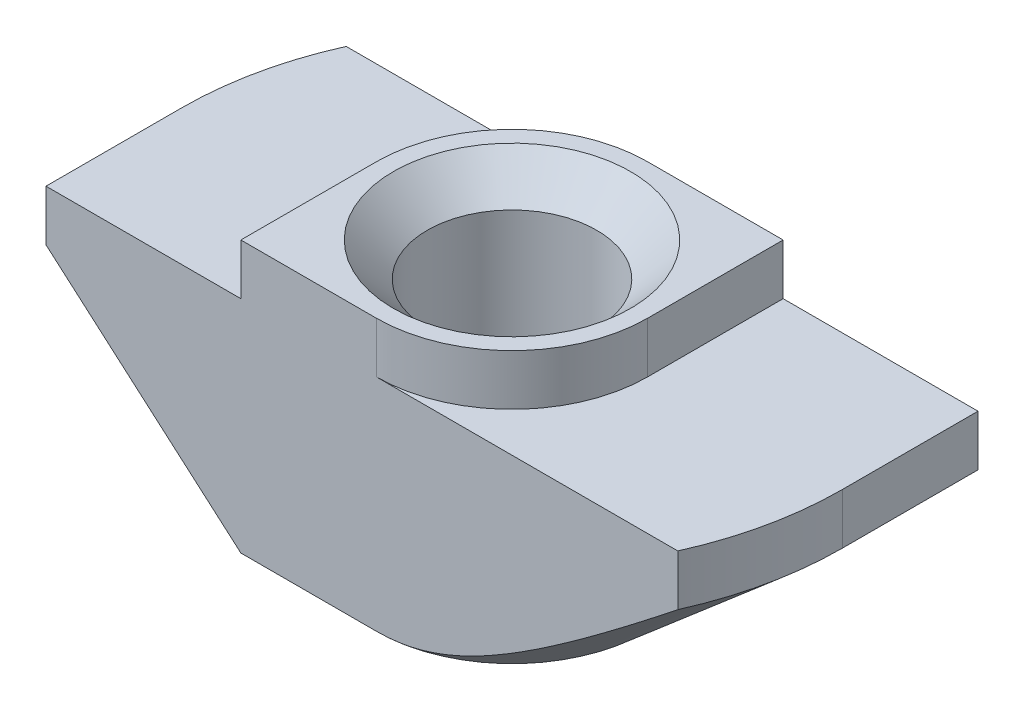
ISO-10303-21;
HEADER;
FILE_DESCRIPTION(('STEP AP214'),'2;1');
FILE_NAME('part.step','',(''),(''),'','','');
FILE_SCHEMA(('AUTOMOTIVE_DESIGN { 1 0 10303 214 1 1 1 1 }'));
ENDSEC;
DATA;
#1=APPLICATION_CONTEXT('core data for automotive mechanical design processes');
#2=APPLICATION_PROTOCOL_DEFINITION('international standard','automotive_design',2000,#1);
#3=PRODUCT_CONTEXT('',#1,'mechanical');
#4=PRODUCT('Part','Part','',(#3));
#5=PRODUCT_RELATED_PRODUCT_CATEGORY('part','',(#4));
#6=PRODUCT_DEFINITION_FORMATION('','',#4);
#7=PRODUCT_DEFINITION_CONTEXT('part definition',#1,'design');
#8=PRODUCT_DEFINITION('design','',#6,#7);
#9=PRODUCT_DEFINITION_SHAPE('','',#8);
#10=(LENGTH_UNIT() NAMED_UNIT(*) SI_UNIT(.MILLI.,.METRE.));
#11=(NAMED_UNIT(*) PLANE_ANGLE_UNIT() SI_UNIT($,.RADIAN.));
#12=(NAMED_UNIT(*) SI_UNIT($,.STERADIAN.) SOLID_ANGLE_UNIT());
#13=UNCERTAINTY_MEASURE_WITH_UNIT(LENGTH_MEASURE(1.E-05),#10,'distance_accuracy_value','');
#14=(GEOMETRIC_REPRESENTATION_CONTEXT(3) GLOBAL_UNCERTAINTY_ASSIGNED_CONTEXT((#13)) GLOBAL_UNIT_ASSIGNED_CONTEXT((#10,
#11,#12)) REPRESENTATION_CONTEXT('',''));
#15=CARTESIAN_POINT('',(0.,0.,0.));
#16=DIRECTION('',(0.,0.,1.));
#17=DIRECTION('',(1.,0.,0.));
#18=AXIS2_PLACEMENT_3D('',#15,#16,#17);
#19=CARTESIAN_POINT('',(-9.75,-1.5,4.));
#20=DIRECTION('',(1.,0.,0.));
#21=DIRECTION('',(0.,0.,-1.));
#22=AXIS2_PLACEMENT_3D('',#19,#20,#21);
#23=PLANE('',#22);
#24=DIRECTION('',(0.,0.,-1.));
#25=VECTOR('',#24,1.);
#26=CARTESIAN_POINT('',(-9.75,-3.,4.));
#27=LINE('',#26,#25);
#28=CARTESIAN_POINT('',(-9.75,-3.,4.));
#29=VERTEX_POINT('',#28);
#30=CARTESIAN_POINT('',(-9.75,-3.,0.));
#31=VERTEX_POINT('',#30);
#32=EDGE_CURVE('E317',#29,#31,#27,.T.);
#33=ORIENTED_EDGE('',*,*,#32,.F.);
#34=DIRECTION('',(0.,-1.,0.));
#35=VECTOR('',#34,1.);
#36=CARTESIAN_POINT('',(-9.75,-1.5,4.));
#37=LINE('',#36,#35);
#38=CARTESIAN_POINT('',(-9.75,-1.5,4.));
#39=VERTEX_POINT('',#38);
#40=EDGE_CURVE('E163',#39,#29,#37,.T.);
#41=ORIENTED_EDGE('',*,*,#40,.F.);
#42=DIRECTION('',(0.,0.,-1.));
#43=VECTOR('',#42,1.);
#44=CARTESIAN_POINT('',(-9.75,-1.5,4.));
#45=LINE('',#44,#43);
#46=CARTESIAN_POINT('',(-9.75,-1.5,0.));
#47=VERTEX_POINT('',#46);
#48=EDGE_CURVE('E45',#39,#47,#45,.T.);
#49=ORIENTED_EDGE('',*,*,#48,.T.);
#50=DIRECTION('',(0.,1.,0.));
#51=VECTOR('',#50,1.);
#52=CARTESIAN_POINT('',(-9.75,-8.,0.));
#53=LINE('',#52,#51);
#54=EDGE_CURVE('E209',#31,#47,#53,.T.);
#55=ORIENTED_EDGE('',*,*,#54,.F.);
#56=EDGE_LOOP('',(#33,#41,#49,#55));
#57=FACE_BOUND('',#56,.T.);
#58=ADVANCED_FACE('F37',(#57),#23,.F.);
#59=CARTESIAN_POINT('',(-9.75,-8.,4.));
#60=DIRECTION('',(0.,1.,0.));
#61=DIRECTION('',(0.,0.,1.));
#62=AXIS2_PLACEMENT_3D('',#59,#60,#61);
#63=PLANE('',#62);
#64=CARTESIAN_POINT('',(0.,-8.,0.));
#65=DIRECTION('',(0.,1.,0.));
#66=DIRECTION('',(0.,0.,1.));
#67=AXIS2_PLACEMENT_3D('',#64,#65,#66);
#68=CIRCLE('',#67,3.5);
#69=CARTESIAN_POINT('',(0.,-8.,3.5));
#70=VERTEX_POINT('',#69);
#71=EDGE_CURVE('E258',#70,#70,#68,.T.);
#72=ORIENTED_EDGE('',*,*,#71,.T.);
#73=EDGE_LOOP('',(#72));
#74=FACE_BOUND('',#73,.T.);
#75=DIRECTION('',(1.,0.,0.));
#76=VECTOR('',#75,1.);
#77=CARTESIAN_POINT('',(-9.75,-8.,4.));
#78=LINE('',#77,#76);
#79=CARTESIAN_POINT('',(-4.,-8.,4.));
#80=VERTEX_POINT('',#79);
#81=CARTESIAN_POINT('',(0.,-8.,4.));
#82=VERTEX_POINT('',#81);
#83=EDGE_CURVE('E161',#80,#82,#78,.T.);
#84=ORIENTED_EDGE('',*,*,#83,.F.);
#85=DIRECTION('',(0.,0.,-1.));
#86=VECTOR('',#85,1.);
#87=CARTESIAN_POINT('',(-4.,-8.,4.));
#88=LINE('',#87,#86);
#89=CARTESIAN_POINT('',(-4.,-8.,0.));
#90=VERTEX_POINT('',#89);
#91=EDGE_CURVE('E146',#80,#90,#88,.T.);
#92=ORIENTED_EDGE('',*,*,#91,.T.);
#93=CARTESIAN_POINT('',(0.,-8.,0.));
#94=DIRECTION('',(0.,-1.,0.));
#95=DIRECTION('',(-1.,0.,0.));
#96=AXIS2_PLACEMENT_3D('',#93,#94,#95);
#97=CIRCLE('',#96,4.);
#98=CARTESIAN_POINT('',(0.,-8.,-4.));
#99=VERTEX_POINT('',#98);
#100=EDGE_CURVE('E318',#90,#99,#97,.T.);
#101=ORIENTED_EDGE('',*,*,#100,.T.);
#102=DIRECTION('',(1.,0.,0.));
#103=VECTOR('',#102,1.);
#104=CARTESIAN_POINT('',(-9.75,-8.,-4.));
#105=LINE('',#104,#103);
#106=CARTESIAN_POINT('',(4.,-8.,-4.));
#107=VERTEX_POINT('',#106);
#108=EDGE_CURVE('E181',#99,#107,#105,.T.);
#109=ORIENTED_EDGE('',*,*,#108,.T.);
#110=DIRECTION('',(0.,0.,1.));
#111=VECTOR('',#110,1.);
#112=CARTESIAN_POINT('',(4.,-8.,-9.75));
#113=LINE('',#112,#111);
#114=CARTESIAN_POINT('',(4.,-8.,0.));
#115=VERTEX_POINT('',#114);
#116=EDGE_CURVE('E52',#107,#115,#113,.T.);
#117=ORIENTED_EDGE('',*,*,#116,.T.);
#118=CARTESIAN_POINT('',(0.,-8.,0.));
#119=DIRECTION('',(0.,-1.,0.));
#120=DIRECTION('',(1.,0.,0.));
#121=AXIS2_PLACEMENT_3D('',#118,#119,#120);
#122=CIRCLE('',#121,4.);
#123=EDGE_CURVE('E167',#115,#82,#122,.T.);
#124=ORIENTED_EDGE('',*,*,#123,.T.);
#125=EDGE_LOOP('',(#84,#92,#101,#109,#117,#124));
#126=FACE_BOUND('',#125,.T.);
#127=ADVANCED_FACE('F166',(#74,#126),#63,.F.);
#128=CARTESIAN_POINT('',(9.75,-1.5,4.));
#129=DIRECTION('',(-1.,0.,0.));
#130=DIRECTION('',(0.,0.,1.));
#131=AXIS2_PLACEMENT_3D('',#128,#129,#130);
#132=PLANE('',#131);
#133=DIRECTION('',(0.,0.,1.));
#134=VECTOR('',#133,1.);
#135=CARTESIAN_POINT('',(9.75,-3.,-9.75));
#136=LINE('',#135,#134);
#137=CARTESIAN_POINT('',(9.75,-3.,-4.));
#138=VERTEX_POINT('',#137);
#139=CARTESIAN_POINT('',(9.75,-3.,0.));
#140=VERTEX_POINT('',#139);
#141=EDGE_CURVE('E305',#138,#140,#136,.T.);
#142=ORIENTED_EDGE('',*,*,#141,.F.);
#143=DIRECTION('',(0.,1.,0.));
#144=VECTOR('',#143,1.);
#145=CARTESIAN_POINT('',(9.75,-1.5,-4.));
#146=LINE('',#145,#144);
#147=CARTESIAN_POINT('',(9.75,-1.5,-4.));
#148=VERTEX_POINT('',#147);
#149=EDGE_CURVE('E185',#138,#148,#146,.T.);
#150=ORIENTED_EDGE('',*,*,#149,.T.);
#151=DIRECTION('',(0.,0.,-1.));
#152=VECTOR('',#151,1.);
#153=CARTESIAN_POINT('',(9.75,-1.5,4.));
#154=LINE('',#153,#152);
#155=CARTESIAN_POINT('',(9.75,-1.5,0.));
#156=VERTEX_POINT('',#155);
#157=EDGE_CURVE('E203',#156,#148,#154,.T.);
#158=ORIENTED_EDGE('',*,*,#157,.F.);
#159=DIRECTION('',(0.,1.,0.));
#160=VECTOR('',#159,1.);
#161=CARTESIAN_POINT('',(9.75,-8.,0.));
#162=LINE('',#161,#160);
#163=EDGE_CURVE('E220',#140,#156,#162,.T.);
#164=ORIENTED_EDGE('',*,*,#163,.F.);
#165=EDGE_LOOP('',(#142,#150,#158,#164));
#166=FACE_BOUND('',#165,.T.);
#167=ADVANCED_FACE('F304',(#166),#132,.F.);
#168=CARTESIAN_POINT('',(0.,0.,4.));
#169=DIRECTION('',(0.,0.,-1.));
#170=DIRECTION('',(-1.,0.,0.));
#171=AXIS2_PLACEMENT_3D('',#168,#169,#170);
#172=PLANE('',#171);
#173=DIRECTION('',(-0.754605522163505,0.656178714924787,0.));
#174=VECTOR('',#173,1.);
#175=CARTESIAN_POINT('',(-4.,-8.,4.));
#176=LINE('',#175,#174);
#177=EDGE_CURVE('E149',#80,#29,#176,.T.);
#178=ORIENTED_EDGE('',*,*,#177,.F.);
#179=ORIENTED_EDGE('',*,*,#83,.T.);
#180=CARTESIAN_POINT('',(19.0930125034409,5.48479531743841,4.));
#181=CARTESIAN_POINT('',(18.5778133169644,5.04634478096504,4.));
#182=CARTESIAN_POINT('',(18.0622729802475,4.60829381291386,4.));
#183=CARTESIAN_POINT('',(17.0302280235104,3.73329525980051,4.));
#184=CARTESIAN_POINT('',(16.5137233725138,3.29634771128181,4.));
#185=CARTESIAN_POINT('',(15.47863444366,2.42315755061796,4.));
#186=CARTESIAN_POINT('',(14.9600481309705,1.98691734873569,4.));
#187=CARTESIAN_POINT('',(13.9212553406501,1.11639739796508,4.));
#188=CARTESIAN_POINT('',(13.401048906075,0.682117597716457,4.));
#189=CARTESIAN_POINT('',(12.3246773818503,-0.21175731208505,4.));
#190=CARTESIAN_POINT('',(11.7683628761931,-0.671172901903966,4.));
#191=CARTESIAN_POINT('',(10.9310662928984,-1.35689819172363,4.));
#192=CARTESIAN_POINT('',(10.6514842055428,-1.58491694423187,4.));
#193=CARTESIAN_POINT('',(10.0911578682021,-2.03952130793857,4.));
#194=CARTESIAN_POINT('',(9.81041362223716,-2.26610692408762,4.));
#195=CARTESIAN_POINT('',(9.24775627916612,-2.71723925573111,4.));
#196=CARTESIAN_POINT('',(8.96584464993702,-2.94178780024051,4.));
#197=CARTESIAN_POINT('',(8.40017784545761,-3.38854835363034,4.));
#198=CARTESIAN_POINT('',(8.11642269007676,-3.61076038762625,4.));
#199=CARTESIAN_POINT('',(7.54655666760194,-4.05206638411712,4.));
#200=CARTESIAN_POINT('',(7.26044612879617,-4.27116076990599,4.));
#201=CARTESIAN_POINT('',(6.68506947716327,-4.70515877749395,4.));
#202=CARTESIAN_POINT('',(6.39580350808307,-4.92006258896335,4.));
#203=CARTESIAN_POINT('',(5.94380391200236,-5.24880354329621,4.));
#204=CARTESIAN_POINT('',(5.7825678290859,-5.3646987592163,4.));
#205=CARTESIAN_POINT('',(5.45852078349081,-5.59427839205067,4.));
#206=CARTESIAN_POINT('',(5.29570978752578,-5.70796276208432,4.));
#207=CARTESIAN_POINT('',(4.96801437116113,-5.93271086070198,4.));
#208=CARTESIAN_POINT('',(4.80312782045187,-6.04377149083704,4.));
#209=CARTESIAN_POINT('',(4.47106545917387,-6.26241638816355,4.));
#210=CARTESIAN_POINT('',(4.3038897228336,-6.37000076769662,4.));
#211=CARTESIAN_POINT('',(3.96779734207744,-6.58006534355457,4.));
#212=CARTESIAN_POINT('',(3.79889805399672,-6.68257318482784,4.));
#213=CARTESIAN_POINT('',(3.45771491043147,-6.88190221849361,4.));
#214=CARTESIAN_POINT('',(3.28543046434657,-6.97872240660534,4.));
#215=CARTESIAN_POINT('',(2.93709738155444,-7.1646860244681,4.));
#216=CARTESIAN_POINT('',(2.76105538763457,-7.25384179412908,4.));
#217=CARTESIAN_POINT('',(2.40427915744407,-7.42212304050504,4.));
#218=CARTESIAN_POINT('',(2.22354728037757,-7.50125344690475,4.));
#219=CARTESIAN_POINT('',(1.87877415331493,-7.6374635749479,4.));
#220=CARTESIAN_POINT('',(1.71533550918919,-7.69605023700292,4.));
#221=CARTESIAN_POINT('',(1.3842626600524,-7.80005250313673,4.));
#222=CARTESIAN_POINT('',(1.21662899480356,-7.84546979231455,4.));
#223=CARTESIAN_POINT('',(0.879640019068342,-7.9196719407948,4.));
#224=CARTESIAN_POINT('',(0.710326071439545,-7.94864036786479,4.));
#225=CARTESIAN_POINT('',(0.369553218503112,-7.9882685957749,4.));
#226=CARTESIAN_POINT('',(0.198094873403108,-7.99893308174377,4.));
#227=CARTESIAN_POINT('',(-0.14622215115853,-8.00092076503876,4.));
#228=CARTESIAN_POINT('',(-0.319081718741123,-7.9920988065105,4.));
#229=CARTESIAN_POINT('',(-0.66279617162969,-7.95570116318786,4.));
#230=CARTESIAN_POINT('',(-0.833650530135947,-7.92812065766392,4.));
#231=CARTESIAN_POINT('',(-1.17380899940443,-7.85620687940474,4.));
#232=CARTESIAN_POINT('',(-1.34307188352269,-7.811682245836,4.));
#233=CARTESIAN_POINT('',(-1.59373756175264,-7.73469658263694,4.));
#234=CARTESIAN_POINT('',(-1.67676247755531,-7.70733179971942,4.));
#235=CARTESIAN_POINT('',(-1.8417517988474,-7.6495708706268,4.));
#236=CARTESIAN_POINT('',(-1.92371622948916,-7.6191747964966,4.));
#237=CARTESIAN_POINT('',(-2.13504326669252,-7.53682619979317,4.));
#238=CARTESIAN_POINT('',(-2.26359986699921,-7.48280578099689,4.));
#239=CARTESIAN_POINT('',(-2.51824420204764,-7.36919866655113,4.));
#240=CARTESIAN_POINT('',(-2.64433129566204,-7.3096105480052,4.));
#241=CARTESIAN_POINT('',(-2.89436868902728,-7.18584959519642,4.));
#242=CARTESIAN_POINT('',(-3.01831691948272,-7.12167259961822,4.));
#243=CARTESIAN_POINT('',(-3.26422266973225,-6.98960098632555,4.));
#244=CARTESIAN_POINT('',(-3.38617997843972,-6.92170597769097,4.));
#245=CARTESIAN_POINT('',(-3.75029646649663,-6.71298185031499,4.));
#246=CARTESIAN_POINT('',(-3.98982159172294,-6.56756033192358,4.));
#247=CARTESIAN_POINT('',(-4.46340938681992,-6.26843578703017,4.));
#248=CARTESIAN_POINT('',(-4.69747464234275,-6.11473679951732,4.));
#249=CARTESIAN_POINT('',(-5.16321438853325,-5.80025182347771,4.));
#250=CARTESIAN_POINT('',(-5.39485991399544,-5.63942310121265,4.));
#251=CARTESIAN_POINT('',(-5.85502306619878,-5.31332270165477,4.));
#252=CARTESIAN_POINT('',(-6.08354037524194,-5.14805057807379,4.));
#253=CARTESIAN_POINT('',(-6.53765735729361,-4.81451787561935,4.));
#254=CARTESIAN_POINT('',(-6.76326204804518,-4.64626411196043,4.));
#255=CARTESIAN_POINT('',(-7.21253368666862,-4.3072099865075,4.));
#256=CARTESIAN_POINT('',(-7.43620070078051,-4.13640971231412,4.));
#257=CARTESIAN_POINT('',(-7.87440605894757,-3.79864870939196,4.));
#258=CARTESIAN_POINT('',(-8.08899613000098,-3.6317549946429,4.));
#259=CARTESIAN_POINT('',(-8.51708866686722,-3.29638802975018,4.));
#260=CARTESIAN_POINT('',(-8.73059061658266,-3.12791412140789,4.));
#261=CARTESIAN_POINT('',(-9.15412189702873,-2.79172022690956,4.));
#262=CARTESIAN_POINT('',(-9.36416259813433,-2.62401455116661,4.));
#263=CARTESIAN_POINT('',(-9.78334542346964,-2.28767615731866,4.));
#264=CARTESIAN_POINT('',(-9.99248790937981,-2.11904389012149,4.));
#265=CARTESIAN_POINT('',(-10.2013028815516,-1.95000895828563,4.));
#266=B_SPLINE_CURVE_WITH_KNOTS('',3,(#180,#181,#182,#183,#184,#185,#186,#187,#188,#189,#190,
#191,#192,#193,#194,#195,#196,#197,#198,#199,#200,#201,#202,#203,#204,#205,#206,#207,#208,#209,
#210,#211,#212,#213,#214,#215,#216,#217,#218,#219,#220,#221,#222,#223,#224,#225,#226,#227,#228,
#229,#230,#231,#232,#233,#234,#235,#236,#237,#238,#239,#240,#241,#242,#243,#244,#245,#246,#247,
#248,#249,#250,#251,#252,#253,#254,#255,#256,#257,#258,#259,#260,#261,#262,#263,#264,#265),
.UNSPECIFIED.,.F.,.F.,(4,2,2,2,2,2,2,2,2,2,2,2,2,2,2,2,2,2,2,2,2,2,2,2,2,2,2,2,2,2,2,2,2,2,2,2,
2,2,2,2,2,2,4),(0.,2.02953833455181,4.05914302502208,6.09215065585671,8.12510471143518,
10.2895570428798,11.371878906685,12.4541970297015,13.535421419087,14.6166341743324,
15.6976987012863,16.7787141838814,17.3744003174641,17.9700990687338,18.5664692951226,
19.1628202293636,19.7554524823498,20.3481890650503,20.9399527193616,21.5314242521027,
22.0518540383534,22.572217203124,23.086652881933,23.6009568646764,24.1191048434135,
24.637386030525,25.1617030827551,25.4239118441335,25.6861143750633,26.1042775249438,
26.5225478355647,26.9412023765355,27.3599010206039,28.2002514013315,29.0401953843998,
29.8861310854953,30.7321520707985,31.576440022776,32.4206989977375,33.236240856672,
34.052139001134,34.8584735236023,35.6644453613211),.UNSPECIFIED.);
#267=CARTESIAN_POINT('',(8.89170962188937,-3.,4.));
#268=VERTEX_POINT('',#267);
#269=EDGE_CURVE('E322',#268,#82,#266,.T.);
#270=ORIENTED_EDGE('',*,*,#269,.F.);
#271=DIRECTION('',(0.,1.,0.));
#272=VECTOR('',#271,1.);
#273=CARTESIAN_POINT('',(8.89170962188937,-8.,4.));
#274=LINE('',#273,#272);
#275=CARTESIAN_POINT('',(8.89170962188937,-1.5,4.));
#276=VERTEX_POINT('',#275);
#277=EDGE_CURVE('E223',#268,#276,#274,.T.);
#278=ORIENTED_EDGE('',*,*,#277,.T.);
#279=DIRECTION('',(-1.,0.,0.));
#280=VECTOR('',#279,1.);
#281=CARTESIAN_POINT('',(4.,-1.5,4.));
#282=LINE('',#281,#280);
#283=CARTESIAN_POINT('',(0.,-1.5,4.));
#284=VERTEX_POINT('',#283);
#285=EDGE_CURVE('E168',#276,#284,#282,.T.);
#286=ORIENTED_EDGE('',*,*,#285,.T.);
#287=DIRECTION('',(0.,1.,0.));
#288=VECTOR('',#287,1.);
#289=CARTESIAN_POINT('',(0.,-7.15685424949238,4.));
#290=LINE('',#289,#288);
#291=CARTESIAN_POINT('',(0.,0.,4.));
#292=VERTEX_POINT('',#291);
#293=EDGE_CURVE('E246',#284,#292,#290,.T.);
#294=ORIENTED_EDGE('',*,*,#293,.T.);
#295=DIRECTION('',(-1.,0.,0.));
#296=VECTOR('',#295,1.);
#297=CARTESIAN_POINT('',(4.,0.,4.));
#298=LINE('',#297,#296);
#299=CARTESIAN_POINT('',(-4.,0.,4.));
#300=VERTEX_POINT('',#299);
#301=EDGE_CURVE('E170',#292,#300,#298,.T.);
#302=ORIENTED_EDGE('',*,*,#301,.T.);
#303=DIRECTION('',(0.,-1.,0.));
#304=VECTOR('',#303,1.);
#305=CARTESIAN_POINT('',(-4.,0.,4.));
#306=LINE('',#305,#304);
#307=CARTESIAN_POINT('',(-4.,-1.5,4.));
#308=VERTEX_POINT('',#307);
#309=EDGE_CURVE('E196',#300,#308,#306,.T.);
#310=ORIENTED_EDGE('',*,*,#309,.T.);
#311=DIRECTION('',(-1.,0.,0.));
#312=VECTOR('',#311,1.);
#313=CARTESIAN_POINT('',(-4.,-1.5,4.));
#314=LINE('',#313,#312);
#315=EDGE_CURVE('E172',#308,#39,#314,.T.);
#316=ORIENTED_EDGE('',*,*,#315,.T.);
#317=ORIENTED_EDGE('',*,*,#40,.T.);
#318=EDGE_LOOP('',(#178,#179,#270,#278,#286,#294,#302,#310,#316,#317));
#319=FACE_BOUND('',#318,.T.);
#320=ADVANCED_FACE('F159',(#319),#172,.F.);
#321=CARTESIAN_POINT('',(0.,0.,-4.));
#322=DIRECTION('',(0.,0.,-1.));
#323=DIRECTION('',(-1.,0.,0.));
#324=AXIS2_PLACEMENT_3D('',#321,#322,#323);
#325=PLANE('',#324);
#326=ORIENTED_EDGE('',*,*,#108,.F.);
#327=CARTESIAN_POINT('',(10.2013028815516,-1.95000895828561,-4.));
#328=CARTESIAN_POINT('',(10.0339198393362,-2.08551143614665,-4.));
#329=CARTESIAN_POINT('',(9.86632283217457,-2.2207499092589,-4.));
#330=CARTESIAN_POINT('',(9.5306291113076,-2.49060788617074,-4.));
#331=CARTESIAN_POINT('',(9.3625323935981,-2.6252273849884,-4.));
#332=CARTESIAN_POINT('',(8.85711014174881,-3.02824011005636,-4.));
#333=CARTESIAN_POINT('',(8.51892952893781,-3.29556281198958,-4.));
#334=CARTESIAN_POINT('',(7.82606328189803,-3.83681323070731,-4.));
#335=CARTESIAN_POINT('',(7.47125417808717,-4.11058357354471,-4.));
#336=CARTESIAN_POINT('',(6.93566544519761,-4.51652980873558,-4.));
#337=CARTESIAN_POINT('',(6.75663624561629,-4.65101435659177,-4.));
#338=CARTESIAN_POINT('',(6.39716787276301,-4.91808381202073,-4.));
#339=CARTESIAN_POINT('',(6.21672871850456,-5.05066874514209,-4.));
#340=CARTESIAN_POINT('',(5.85418369277563,-5.31345193555315,-4.));
#341=CARTESIAN_POINT('',(5.67207823226353,-5.44365075874076,-4.));
#342=CARTESIAN_POINT('',(5.30576731880303,-5.70107997472775,-4.));
#343=CARTESIAN_POINT('',(5.12156180206058,-5.82831027699185,-4.));
#344=CARTESIAN_POINT('',(4.75011127026993,-6.07925940964712,-4.));
#345=CARTESIAN_POINT('',(4.56285994512742,-6.20296893308306,-4.));
#346=CARTESIAN_POINT('',(4.18513224883839,-6.44535805808298,-4.));
#347=CARTESIAN_POINT('',(3.99465611805763,-6.56403803224218,-4.));
#348=CARTESIAN_POINT('',(3.61304128488062,-6.79266272765141,-4.));
#349=CARTESIAN_POINT('',(3.42197306424269,-6.90272431468641,-4.));
#350=CARTESIAN_POINT('',(3.03491286140894,-7.11411820657794,-4.));
#351=CARTESIAN_POINT('',(2.83891889996064,-7.21544692756372,-4.));
#352=CARTESIAN_POINT('',(2.44192184290774,-7.40560938726516,-4.));
#353=CARTESIAN_POINT('',(2.24094385599254,-7.49449488615489,-4.));
#354=CARTESIAN_POINT('',(1.8325063106098,-7.65562668554541,-4.));
#355=CARTESIAN_POINT('',(1.62505480048051,-7.72789278037345,-4.));
#356=CARTESIAN_POINT('',(1.27981814559727,-7.82796451166703,-4.));
#357=CARTESIAN_POINT('',(1.14396110792812,-7.86239848800736,-4.));
#358=CARTESIAN_POINT('',(0.869910445029896,-7.92056970940938,-4.));
#359=CARTESIAN_POINT('',(0.731716453760718,-7.94430526235705,-4.));
#360=CARTESIAN_POINT('',(0.454464556175093,-7.97964173047544,-4.));
#361=CARTESIAN_POINT('',(0.315414459383221,-7.99130291119976,-4.));
#362=CARTESIAN_POINT('',(0.0368276951767137,-8.0019571726022,-4.));
#363=CARTESIAN_POINT('',(-0.102708943731008,-8.00095098340584,-4.));
#364=CARTESIAN_POINT('',(-0.38098249054024,-7.9863455393582,-4.));
#365=CARTESIAN_POINT('',(-0.519720005408902,-7.97275762445244,-4.));
#366=CARTESIAN_POINT('',(-0.795526149407617,-7.93385441309408,-4.));
#367=CARTESIAN_POINT('',(-0.932594595612336,-7.90853784287634,-4.));
#368=CARTESIAN_POINT('',(-1.20518982051904,-7.84736843394937,-4.));
#369=CARTESIAN_POINT('',(-1.34070240327483,-7.81145325217638,-4.));
#370=CARTESIAN_POINT('',(-1.60900813965177,-7.73074156625156,-4.));
#371=CARTESIAN_POINT('',(-1.74180146424736,-7.68594562238459,-4.));
#372=CARTESIAN_POINT('',(-2.06774555470206,-7.56574973434711,-4.));
#373=CARTESIAN_POINT('',(-2.25927747683547,-7.48597990119863,-4.));
#374=CARTESIAN_POINT('',(-2.63698467897033,-7.31453077262157,-4.));
#375=CARTESIAN_POINT('',(-2.82315606434946,-7.22284307246944,-4.));
#376=CARTESIAN_POINT('',(-3.19133344589281,-7.0304609141347,-4.));
#377=CARTESIAN_POINT('',(-3.37332794720551,-6.92974465007832,-4.));
#378=CARTESIAN_POINT('',(-3.7334477915038,-6.72176852295224,-4.));
#379=CARTESIAN_POINT('',(-3.91157408445031,-6.6145102916867,-4.));
#380=CARTESIAN_POINT('',(-4.26690326443273,-6.39365749074014,-4.));
#381=CARTESIAN_POINT('',(-4.444067421961,-6.2800009179053,-4.));
#382=CARTESIAN_POINT('',(-4.79581550110569,-6.0487604594614,-4.));
#383=CARTESIAN_POINT('',(-4.97039930014717,-5.93117638814353,-4.));
#384=CARTESIAN_POINT('',(-5.31718243657692,-5.69312760113897,-4.));
#385=CARTESIAN_POINT('',(-5.48938509058574,-5.57266770382255,-4.));
#386=CARTESIAN_POINT('',(-5.832052772288,-5.32931648933681,-4.));
#387=CARTESIAN_POINT('',(-6.0025178459933,-5.20642523680557,-4.));
#388=CARTESIAN_POINT('',(-6.46417550999881,-4.86955059087449,-4.));
#389=CARTESIAN_POINT('',(-6.75397131864408,-4.6536542948738,-4.));
#390=CARTESIAN_POINT('',(-7.33046309681157,-4.217755036655,-4.));
#391=CARTESIAN_POINT('',(-7.61715893303351,-3.99775189894105,-4.));
#392=CARTESIAN_POINT('',(-8.18823393079153,-3.55468662675595,-4.));
#393=CARTESIAN_POINT('',(-8.47261278287653,-3.33162409401831,-4.));
#394=CARTESIAN_POINT('',(-9.03955595713135,-2.88320266419135,-4.));
#395=CARTESIAN_POINT('',(-9.32212026063873,-2.6578437435454,-4.));
#396=CARTESIAN_POINT('',(-9.886143453162,-2.20508818164028,-4.));
#397=CARTESIAN_POINT('',(-10.1676007023281,-1.97768949943048,-4.));
#398=CARTESIAN_POINT('',(-10.7293691975362,-1.52148028275231,-4.));
#399=CARTESIAN_POINT('',(-11.0096804397628,-1.29266974358973,-4.));
#400=CARTESIAN_POINT('',(-11.8491851542355,-0.604591320533747,-4.));
#401=CARTESIAN_POINT('',(-12.4069971523932,-0.143638301746192,-4.));
#402=CARTESIAN_POINT('',(-13.4777900145884,0.746108447391972,-4.));
#403=CARTESIAN_POINT('',(-13.9909542215763,1.17468201561434,-4.));
#404=CARTESIAN_POINT('',(-15.0157237514183,2.03371405569384,-4.));
#405=CARTESIAN_POINT('',(-15.5273290352433,2.46417257409544,-4.));
#406=CARTESIAN_POINT('',(-16.5484683455278,3.32572688529102,-4.));
#407=CARTESIAN_POINT('',(-17.0580044304759,3.7568202401299,-4.));
#408=CARTESIAN_POINT('',(-18.0761421237496,4.6200775417147,-4.));
#409=CARTESIAN_POINT('',(-18.5847437603499,5.05224145510645,-4.));
#410=CARTESIAN_POINT('',(-19.0930125034409,5.48479531743842,-4.));
#411=B_SPLINE_CURVE_WITH_KNOTS('',3,(#327,#328,#329,#330,#331,#332,#333,#334,#335,#336,#337,
#338,#339,#340,#341,#342,#343,#344,#345,#346,#347,#348,#349,#350,#351,#352,#353,#354,#355,#356,
#357,#358,#359,#360,#361,#362,#363,#364,#365,#366,#367,#368,#369,#370,#371,#372,#373,#374,#375,
#376,#377,#378,#379,#380,#381,#382,#383,#384,#385,#386,#387,#388,#389,#390,#391,#392,#393,#394,
#395,#396,#397,#398,#399,#400,#401,#402,#403,#404,#405,#406,#407,#408,#409,#410),.UNSPECIFIED.,
.F.,.F.,(4,2,2,2,2,2,2,2,2,2,2,2,2,2,2,2,2,2,2,2,2,2,2,2,2,2,2,2,2,2,2,2,2,2,2,2,2,2,2,2,2,4),
(0.,0.646066469562852,1.29213813004586,2.58535159892046,3.92975214476226,4.60148503690557,
5.27320888617807,5.94477130988362,6.6163541884943,7.28957271997509,7.96274129110434,
8.6240786797822,9.28568619424606,9.94445418525195,10.6024334479883,11.0225346289763,
11.442702231889,11.8607624364611,12.2787985448689,12.6964582424969,13.1141633097869,
13.5343761117408,13.9545624110161,14.576405787849,15.1986901050663,15.8225200909053,
16.4461951022656,17.0775908972504,17.709016589694,18.3394497925658,18.9698662577038,
20.0539373371927,21.1380548483351,22.2223148532865,23.3065859919301,24.3921009102971,
25.4776194397949,27.6484733081619,29.6542390606716,31.6600546233868,33.6623558511828,
35.6645954610344),.UNSPECIFIED.);
#412=CARTESIAN_POINT('',(-8.89170962188937,-3.,-4.));
#413=VERTEX_POINT('',#412);
#414=EDGE_CURVE('E227',#99,#413,#411,.T.);
#415=ORIENTED_EDGE('',*,*,#414,.T.);
#416=DIRECTION('',(0.,1.,0.));
#417=VECTOR('',#416,1.);
#418=CARTESIAN_POINT('',(-8.89170962188937,-8.,-4.));
#419=LINE('',#418,#417);
#420=CARTESIAN_POINT('',(-8.89170962188937,-1.5,-4.));
#421=VERTEX_POINT('',#420);
#422=EDGE_CURVE('E219',#413,#421,#419,.T.);
#423=ORIENTED_EDGE('',*,*,#422,.T.);
#424=DIRECTION('',(-1.,0.,0.));
#425=VECTOR('',#424,1.);
#426=CARTESIAN_POINT('',(-4.,-1.5,-4.));
#427=LINE('',#426,#425);
#428=CARTESIAN_POINT('',(0.,-1.5,-4.));
#429=VERTEX_POINT('',#428);
#430=EDGE_CURVE('E178',#429,#421,#427,.T.);
#431=ORIENTED_EDGE('',*,*,#430,.F.);
#432=DIRECTION('',(0.,1.,0.));
#433=VECTOR('',#432,1.);
#434=CARTESIAN_POINT('',(0.,-7.15685424949238,-4.));
#435=LINE('',#434,#433);
#436=CARTESIAN_POINT('',(0.,0.,-4.));
#437=VERTEX_POINT('',#436);
#438=EDGE_CURVE('E255',#429,#437,#435,.T.);
#439=ORIENTED_EDGE('',*,*,#438,.T.);
#440=DIRECTION('',(-1.,0.,0.));
#441=VECTOR('',#440,1.);
#442=CARTESIAN_POINT('',(4.,0.,-4.));
#443=LINE('',#442,#441);
#444=CARTESIAN_POINT('',(4.,0.,-4.));
#445=VERTEX_POINT('',#444);
#446=EDGE_CURVE('E193',#445,#437,#443,.T.);
#447=ORIENTED_EDGE('',*,*,#446,.F.);
#448=DIRECTION('',(0.,1.,0.));
#449=VECTOR('',#448,1.);
#450=CARTESIAN_POINT('',(4.,0.,-4.));
#451=LINE('',#450,#449);
#452=CARTESIAN_POINT('',(4.,-1.5,-4.));
#453=VERTEX_POINT('',#452);
#454=EDGE_CURVE('E190',#453,#445,#451,.T.);
#455=ORIENTED_EDGE('',*,*,#454,.F.);
#456=DIRECTION('',(-1.,0.,0.));
#457=VECTOR('',#456,1.);
#458=CARTESIAN_POINT('',(4.,-1.5,-4.));
#459=LINE('',#458,#457);
#460=EDGE_CURVE('E187',#148,#453,#459,.T.);
#461=ORIENTED_EDGE('',*,*,#460,.F.);
#462=ORIENTED_EDGE('',*,*,#149,.F.);
#463=DIRECTION('',(-0.754605522163505,-0.656178714924787,0.));
#464=VECTOR('',#463,1.);
#465=CARTESIAN_POINT('',(5.68353067814855,-6.53606027987083,-4.));
#466=LINE('',#465,#464);
#467=EDGE_CURVE('E314',#138,#107,#466,.T.);
#468=ORIENTED_EDGE('',*,*,#467,.T.);
#469=EDGE_LOOP('',(#326,#415,#423,#431,#439,#447,#455,#461,#462,#468));
#470=FACE_BOUND('',#469,.T.);
#471=ADVANCED_FACE('F283',(#470),#325,.T.);
#472=CARTESIAN_POINT('',(0.,-8.,0.));
#473=DIRECTION('',(0.,1.,0.));
#474=DIRECTION('',(-1.,0.,0.));
#475=AXIS2_PLACEMENT_3D('',#472,#473,#474);
#476=CYLINDRICAL_SURFACE('',#475,9.75);
#477=CARTESIAN_POINT('',(0.,-3.,0.));
#478=DIRECTION('',(0.,-1.,0.));
#479=DIRECTION('',(-1.,0.,0.));
#480=AXIS2_PLACEMENT_3D('',#477,#478,#479);
#481=CIRCLE('',#480,9.75);
#482=EDGE_CURVE('E60',#31,#413,#481,.T.);
#483=ORIENTED_EDGE('',*,*,#482,.F.);
#484=ORIENTED_EDGE('',*,*,#54,.T.);
#485=CARTESIAN_POINT('',(0.,-1.5,0.));
#486=DIRECTION('',(0.,-1.,0.));
#487=DIRECTION('',(-1.,0.,0.));
#488=AXIS2_PLACEMENT_3D('',#485,#486,#487);
#489=CIRCLE('',#488,9.75);
#490=EDGE_CURVE('E215',#47,#421,#489,.T.);
#491=ORIENTED_EDGE('',*,*,#490,.T.);
#492=ORIENTED_EDGE('',*,*,#422,.F.);
#493=EDGE_LOOP('',(#483,#484,#491,#492));
#494=FACE_BOUND('',#493,.T.);
#495=ADVANCED_FACE('F345',(#494),#476,.T.);
#496=CARTESIAN_POINT('',(0.,-8.,0.));
#497=DIRECTION('',(0.,1.,0.));
#498=DIRECTION('',(-1.,0.,0.));
#499=AXIS2_PLACEMENT_3D('',#496,#497,#498);
#500=CYLINDRICAL_SURFACE('',#499,9.75);
#501=CARTESIAN_POINT('',(0.,-3.,0.));
#502=DIRECTION('',(0.,-1.,0.));
#503=DIRECTION('',(1.,0.,0.));
#504=AXIS2_PLACEMENT_3D('',#501,#502,#503);
#505=CIRCLE('',#504,9.75);
#506=EDGE_CURVE('E310',#140,#268,#505,.T.);
#507=ORIENTED_EDGE('',*,*,#506,.F.);
#508=ORIENTED_EDGE('',*,*,#163,.T.);
#509=CARTESIAN_POINT('',(0.,-1.5,0.));
#510=DIRECTION('',(0.,-1.,0.));
#511=DIRECTION('',(1.,0.,0.));
#512=AXIS2_PLACEMENT_3D('',#509,#510,#511);
#513=CIRCLE('',#512,9.75);
#514=EDGE_CURVE('E237',#156,#276,#513,.T.);
#515=ORIENTED_EDGE('',*,*,#514,.T.);
#516=ORIENTED_EDGE('',*,*,#277,.F.);
#517=EDGE_LOOP('',(#507,#508,#515,#516));
#518=FACE_BOUND('',#517,.T.);
#519=ADVANCED_FACE('F348',(#518),#500,.T.);
#520=CARTESIAN_POINT('',(4.,0.,4.));
#521=DIRECTION('',(0.,-1.,0.));
#522=DIRECTION('',(0.,0.,-1.));
#523=AXIS2_PLACEMENT_3D('',#520,#521,#522);
#524=PLANE('',#523);
#525=ORIENTED_EDGE('',*,*,#301,.F.);
#526=CARTESIAN_POINT('',(0.,0.,0.));
#527=DIRECTION('',(0.,-1.,0.));
#528=DIRECTION('',(0.,0.,-1.));
#529=AXIS2_PLACEMENT_3D('',#526,#527,#528);
#530=CIRCLE('',#529,4.);
#531=CARTESIAN_POINT('',(4.,0.,0.));
#532=VERTEX_POINT('',#531);
#533=EDGE_CURVE('E235',#532,#292,#530,.T.);
#534=ORIENTED_EDGE('',*,*,#533,.F.);
#535=DIRECTION('',(0.,0.,-1.));
#536=VECTOR('',#535,1.);
#537=CARTESIAN_POINT('',(4.,0.,4.));
#538=LINE('',#537,#536);
#539=EDGE_CURVE('E199',#532,#445,#538,.T.);
#540=ORIENTED_EDGE('',*,*,#539,.T.);
#541=ORIENTED_EDGE('',*,*,#446,.T.);
#542=CARTESIAN_POINT('',(0.,0.,0.));
#543=DIRECTION('',(0.,-1.,0.));
#544=DIRECTION('',(0.,0.,-1.));
#545=AXIS2_PLACEMENT_3D('',#542,#543,#544);
#546=CIRCLE('',#545,4.);
#547=CARTESIAN_POINT('',(-4.,0.,0.));
#548=VERTEX_POINT('',#547);
#549=EDGE_CURVE('E250',#548,#437,#546,.T.);
#550=ORIENTED_EDGE('',*,*,#549,.F.);
#551=DIRECTION('',(0.,0.,-1.));
#552=VECTOR('',#551,1.);
#553=CARTESIAN_POINT('',(-4.,0.,4.));
#554=LINE('',#553,#552);
#555=EDGE_CURVE('E177',#300,#548,#554,.T.);
#556=ORIENTED_EDGE('',*,*,#555,.F.);
#557=EDGE_LOOP('',(#525,#534,#540,#541,#550,#556));
#558=FACE_BOUND('',#557,.T.);
#559=CARTESIAN_POINT('',(0.,0.,0.));
#560=DIRECTION('',(0.,1.,0.));
#561=DIRECTION('',(0.,0.,1.));
#562=AXIS2_PLACEMENT_3D('',#559,#560,#561);
#563=CIRCLE('',#562,3.5);
#564=CARTESIAN_POINT('',(0.,0.,3.5));
#565=VERTEX_POINT('',#564);
#566=EDGE_CURVE('E262',#565,#565,#563,.T.);
#567=ORIENTED_EDGE('',*,*,#566,.F.);
#568=EDGE_LOOP('',(#567));
#569=FACE_BOUND('',#568,.T.);
#570=ADVANCED_FACE('F286',(#558,#569),#524,.F.);
#571=CARTESIAN_POINT('',(-4.,0.,4.));
#572=DIRECTION('',(1.,0.,0.));
#573=DIRECTION('',(0.,0.,-1.));
#574=AXIS2_PLACEMENT_3D('',#571,#572,#573);
#575=PLANE('',#574);
#576=ORIENTED_EDGE('',*,*,#555,.T.);
#577=DIRECTION('',(0.,1.,0.));
#578=VECTOR('',#577,1.);
#579=CARTESIAN_POINT('',(-4.,-7.15685424949238,0.));
#580=LINE('',#579,#578);
#581=CARTESIAN_POINT('',(-4.,-1.5,0.));
#582=VERTEX_POINT('',#581);
#583=EDGE_CURVE('E252',#582,#548,#580,.T.);
#584=ORIENTED_EDGE('',*,*,#583,.F.);
#585=DIRECTION('',(0.,0.,-1.));
#586=VECTOR('',#585,1.);
#587=CARTESIAN_POINT('',(-4.,-1.5,4.));
#588=LINE('',#587,#586);
#589=EDGE_CURVE('E11',#308,#582,#588,.T.);
#590=ORIENTED_EDGE('',*,*,#589,.F.);
#591=ORIENTED_EDGE('',*,*,#309,.F.);
#592=EDGE_LOOP('',(#576,#584,#590,#591));
#593=FACE_BOUND('',#592,.T.);
#594=ADVANCED_FACE('F39',(#593),#575,.F.);
#595=CARTESIAN_POINT('',(-4.,-1.5,4.));
#596=DIRECTION('',(0.,-1.,0.));
#597=DIRECTION('',(1.,0.,0.));
#598=AXIS2_PLACEMENT_3D('',#595,#596,#597);
#599=PLANE('',#598);
#600=ORIENTED_EDGE('',*,*,#430,.T.);
#601=ORIENTED_EDGE('',*,*,#490,.F.);
#602=ORIENTED_EDGE('',*,*,#48,.F.);
#603=ORIENTED_EDGE('',*,*,#315,.F.);
#604=ORIENTED_EDGE('',*,*,#589,.T.);
#605=CARTESIAN_POINT('',(0.,-1.5,0.));
#606=DIRECTION('',(0.,-1.,0.));
#607=DIRECTION('',(1.,0.,0.));
#608=AXIS2_PLACEMENT_3D('',#605,#606,#607);
#609=CIRCLE('',#608,4.);
#610=EDGE_CURVE('E253',#582,#429,#609,.T.);
#611=ORIENTED_EDGE('',*,*,#610,.T.);
#612=EDGE_LOOP('',(#600,#601,#602,#603,#604,#611));
#613=FACE_BOUND('',#612,.T.);
#614=ADVANCED_FACE('F212',(#613),#599,.F.);
#615=CARTESIAN_POINT('',(4.,-1.5,4.));
#616=DIRECTION('',(0.,-1.,0.));
#617=DIRECTION('',(1.,0.,0.));
#618=AXIS2_PLACEMENT_3D('',#615,#616,#617);
#619=PLANE('',#618);
#620=ORIENTED_EDGE('',*,*,#285,.F.);
#621=ORIENTED_EDGE('',*,*,#514,.F.);
#622=ORIENTED_EDGE('',*,*,#157,.T.);
#623=ORIENTED_EDGE('',*,*,#460,.T.);
#624=DIRECTION('',(0.,0.,-1.));
#625=VECTOR('',#624,1.);
#626=CARTESIAN_POINT('',(4.,-1.5,4.));
#627=LINE('',#626,#625);
#628=CARTESIAN_POINT('',(4.,-1.5,0.));
#629=VERTEX_POINT('',#628);
#630=EDGE_CURVE('E201',#629,#453,#627,.T.);
#631=ORIENTED_EDGE('',*,*,#630,.F.);
#632=CARTESIAN_POINT('',(0.,-1.5,0.));
#633=DIRECTION('',(0.,-1.,0.));
#634=DIRECTION('',(1.,0.,0.));
#635=AXIS2_PLACEMENT_3D('',#632,#633,#634);
#636=CIRCLE('',#635,4.);
#637=EDGE_CURVE('E243',#629,#284,#636,.T.);
#638=ORIENTED_EDGE('',*,*,#637,.T.);
#639=EDGE_LOOP('',(#620,#621,#622,#623,#631,#638));
#640=FACE_BOUND('',#639,.T.);
#641=ADVANCED_FACE('F298',(#640),#619,.F.);
#642=CARTESIAN_POINT('',(4.,0.,4.));
#643=DIRECTION('',(-1.,0.,0.));
#644=DIRECTION('',(0.,0.,1.));
#645=AXIS2_PLACEMENT_3D('',#642,#643,#644);
#646=PLANE('',#645);
#647=ORIENTED_EDGE('',*,*,#539,.F.);
#648=DIRECTION('',(0.,1.,0.));
#649=VECTOR('',#648,1.);
#650=CARTESIAN_POINT('',(4.,-7.15685424949238,0.));
#651=LINE('',#650,#649);
#652=EDGE_CURVE('E242',#629,#532,#651,.T.);
#653=ORIENTED_EDGE('',*,*,#652,.F.);
#654=ORIENTED_EDGE('',*,*,#630,.T.);
#655=ORIENTED_EDGE('',*,*,#454,.T.);
#656=EDGE_LOOP('',(#647,#653,#654,#655));
#657=FACE_BOUND('',#656,.T.);
#658=ADVANCED_FACE('F292',(#657),#646,.F.);
#659=CARTESIAN_POINT('',(0.,-7.,0.));
#660=DIRECTION('',(0.,-1.,0.));
#661=DIRECTION('',(0.,0.,-1.));
#662=AXIS2_PLACEMENT_3D('',#659,#660,#661);
#663=CONICAL_SURFACE('',#662,2.5,0.785398163397448);
#664=ORIENTED_EDGE('',*,*,#71,.F.);
#665=EDGE_LOOP('',(#664));
#666=FACE_BOUND('',#665,.T.);
#667=CARTESIAN_POINT('',(0.,-7.,0.));
#668=DIRECTION('',(0.,1.,0.));
#669=DIRECTION('',(0.,0.,1.));
#670=AXIS2_PLACEMENT_3D('',#667,#668,#669);
#671=CIRCLE('',#670,2.5);
#672=CARTESIAN_POINT('',(0.,-7.,2.5));
#673=VERTEX_POINT('',#672);
#674=EDGE_CURVE('E182',#673,#673,#671,.T.);
#675=ORIENTED_EDGE('',*,*,#674,.T.);
#676=EDGE_LOOP('',(#675));
#677=FACE_BOUND('',#676,.T.);
#678=ADVANCED_FACE('F363',(#666,#677),#663,.F.);
#679=CARTESIAN_POINT('',(0.,0.,0.));
#680=DIRECTION('',(0.,1.,0.));
#681=DIRECTION('',(0.,0.,1.));
#682=AXIS2_PLACEMENT_3D('',#679,#680,#681);
#683=CYLINDRICAL_SURFACE('',#682,2.5);
#684=ORIENTED_EDGE('',*,*,#674,.F.);
#685=EDGE_LOOP('',(#684));
#686=FACE_BOUND('',#685,.T.);
#687=CARTESIAN_POINT('',(0.,-0.999999999999999,0.));
#688=DIRECTION('',(0.,1.,0.));
#689=DIRECTION('',(0.,0.,1.));
#690=AXIS2_PLACEMENT_3D('',#687,#688,#689);
#691=CIRCLE('',#690,2.5);
#692=CARTESIAN_POINT('',(0.,-0.999999999999999,2.5));
#693=VERTEX_POINT('',#692);
#694=EDGE_CURVE('E265',#693,#693,#691,.T.);
#695=ORIENTED_EDGE('',*,*,#694,.T.);
#696=EDGE_LOOP('',(#695));
#697=FACE_BOUND('',#696,.T.);
#698=ADVANCED_FACE('F360',(#686,#697),#683,.F.);
#699=CARTESIAN_POINT('',(0.,0.,0.));
#700=DIRECTION('',(0.,1.,0.));
#701=DIRECTION('',(0.,0.,1.));
#702=AXIS2_PLACEMENT_3D('',#699,#700,#701);
#703=CONICAL_SURFACE('',#702,3.5,0.785398163397449);
#704=ORIENTED_EDGE('',*,*,#694,.F.);
#705=EDGE_LOOP('',(#704));
#706=FACE_BOUND('',#705,.T.);
#707=ORIENTED_EDGE('',*,*,#566,.T.);
#708=EDGE_LOOP('',(#707));
#709=FACE_BOUND('',#708,.T.);
#710=ADVANCED_FACE('F357',(#706,#709),#703,.F.);
#711=CARTESIAN_POINT('',(0.,-7.15685424949238,0.));
#712=DIRECTION('',(0.,1.,0.));
#713=DIRECTION('',(0.,0.,1.));
#714=AXIS2_PLACEMENT_3D('',#711,#712,#713);
#715=CYLINDRICAL_SURFACE('',#714,4.);
#716=ORIENTED_EDGE('',*,*,#583,.T.);
#717=ORIENTED_EDGE('',*,*,#549,.T.);
#718=ORIENTED_EDGE('',*,*,#438,.F.);
#719=ORIENTED_EDGE('',*,*,#610,.F.);
#720=EDGE_LOOP('',(#716,#717,#718,#719));
#721=FACE_BOUND('',#720,.T.);
#722=ADVANCED_FACE('F278',(#721),#715,.T.);
#723=CARTESIAN_POINT('',(0.,-7.15685424949238,0.));
#724=DIRECTION('',(0.,1.,0.));
#725=DIRECTION('',(0.,0.,1.));
#726=AXIS2_PLACEMENT_3D('',#723,#724,#725);
#727=CYLINDRICAL_SURFACE('',#726,4.);
#728=ORIENTED_EDGE('',*,*,#652,.T.);
#729=ORIENTED_EDGE('',*,*,#533,.T.);
#730=ORIENTED_EDGE('',*,*,#293,.F.);
#731=ORIENTED_EDGE('',*,*,#637,.F.);
#732=EDGE_LOOP('',(#728,#729,#730,#731));
#733=FACE_BOUND('',#732,.T.);
#734=ADVANCED_FACE('F340',(#733),#727,.T.);
#735=CARTESIAN_POINT('',(4.,-8.,-9.75));
#736=DIRECTION('',(0.656178714924787,-0.754605522163505,0.));
#737=DIRECTION('',(0.754605522163505,0.656178714924787,0.));
#738=AXIS2_PLACEMENT_3D('',#735,#736,#737);
#739=PLANE('',#738);
#740=ORIENTED_EDGE('',*,*,#141,.T.);
#741=DIRECTION('',(0.754605522163505,0.656178714924787,0.));
#742=VECTOR('',#741,1.);
#743=CARTESIAN_POINT('',(4.,-8.,0.));
#744=LINE('',#743,#742);
#745=EDGE_CURVE('E307',#115,#140,#744,.T.);
#746=ORIENTED_EDGE('',*,*,#745,.F.);
#747=ORIENTED_EDGE('',*,*,#116,.F.);
#748=ORIENTED_EDGE('',*,*,#467,.F.);
#749=EDGE_LOOP('',(#740,#746,#747,#748));
#750=FACE_BOUND('',#749,.T.);
#751=ADVANCED_FACE('F335',(#750),#739,.T.);
#752=CARTESIAN_POINT('',(0.,-8.,0.));
#753=DIRECTION('',(0.,1.,0.));
#754=DIRECTION('',(0.,0.,1.));
#755=AXIS2_PLACEMENT_3D('',#752,#753,#754);
#756=CONICAL_SURFACE('',#755,4.,0.855052737126016);
#757=ORIENTED_EDGE('',*,*,#269,.T.);
#758=ORIENTED_EDGE('',*,*,#123,.F.);
#759=ORIENTED_EDGE('',*,*,#745,.T.);
#760=ORIENTED_EDGE('',*,*,#506,.T.);
#761=EDGE_LOOP('',(#757,#758,#759,#760));
#762=FACE_BOUND('',#761,.T.);
#763=ADVANCED_FACE('F331',(#762),#756,.T.);
#764=CARTESIAN_POINT('',(-4.,-8.,4.));
#765=DIRECTION('',(-0.656178714924787,-0.754605522163505,0.));
#766=DIRECTION('',(0.754605522163504,-0.656178714924787,0.));
#767=AXIS2_PLACEMENT_3D('',#764,#765,#766);
#768=PLANE('',#767);
#769=ORIENTED_EDGE('',*,*,#32,.T.);
#770=DIRECTION('',(-0.754605522163505,0.656178714924787,0.));
#771=VECTOR('',#770,1.);
#772=CARTESIAN_POINT('',(-4.,-8.,0.));
#773=LINE('',#772,#771);
#774=EDGE_CURVE('E151',#90,#31,#773,.T.);
#775=ORIENTED_EDGE('',*,*,#774,.F.);
#776=ORIENTED_EDGE('',*,*,#91,.F.);
#777=ORIENTED_EDGE('',*,*,#177,.T.);
#778=EDGE_LOOP('',(#769,#775,#776,#777));
#779=FACE_BOUND('',#778,.T.);
#780=ADVANCED_FACE('F148',(#779),#768,.T.);
#781=CARTESIAN_POINT('',(0.,-8.,0.));
#782=DIRECTION('',(0.,1.,0.));
#783=DIRECTION('',(0.,0.,1.));
#784=AXIS2_PLACEMENT_3D('',#781,#782,#783);
#785=CONICAL_SURFACE('',#784,4.,0.855052737126016);
#786=ORIENTED_EDGE('',*,*,#100,.F.);
#787=ORIENTED_EDGE('',*,*,#774,.T.);
#788=ORIENTED_EDGE('',*,*,#482,.T.);
#789=ORIENTED_EDGE('',*,*,#414,.F.);
#790=EDGE_LOOP('',(#786,#787,#788,#789));
#791=FACE_BOUND('',#790,.T.);
#792=ADVANCED_FACE('F337',(#791),#785,.T.);
#793=CLOSED_SHELL('',(#58,#127,#167,#320,#471,#495,#519,#570,#594,#614,#641,#658,#678,#698,#710,
#722,#734,#751,#763,#780,#792));
#794=MANIFOLD_SOLID_BREP('B2',#793);
#795=ADVANCED_BREP_SHAPE_REPRESENTATION('',(#18,#794),#14);
#796=SHAPE_DEFINITION_REPRESENTATION(#9,#795);
ENDSEC;
END-ISO-10303-21;
